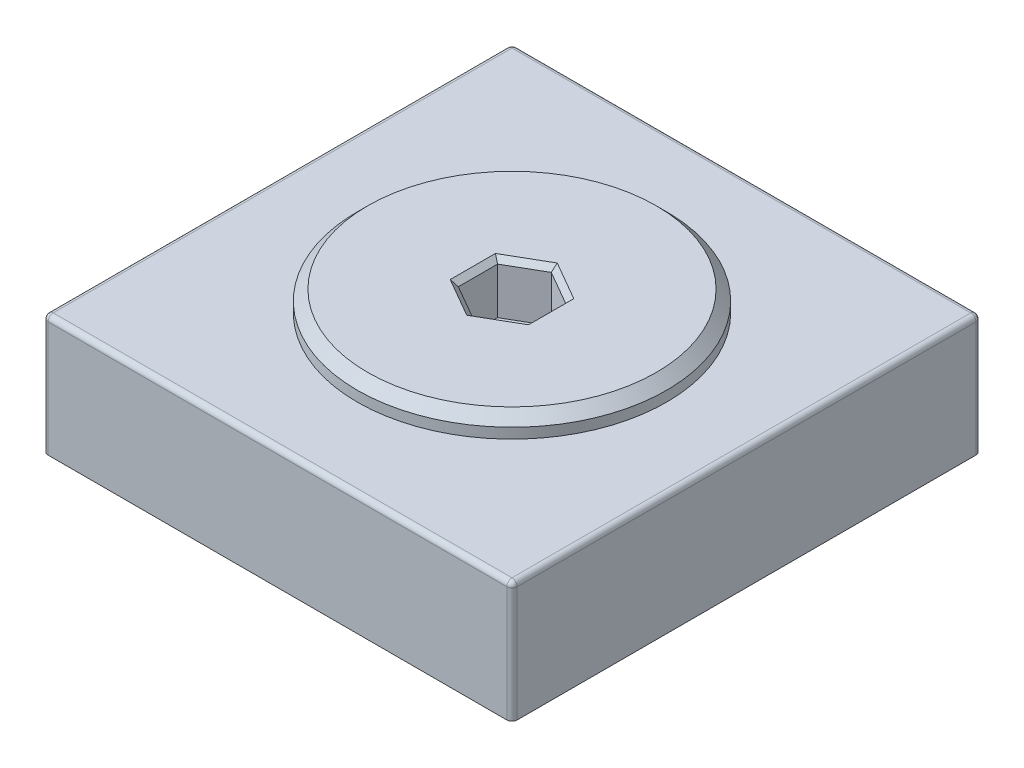
ISO-10303-21;
HEADER;
FILE_DESCRIPTION(('STEP AP214'),'2;1');
FILE_NAME('part.step','',(''),(''),'','','');
FILE_SCHEMA(('AUTOMOTIVE_DESIGN { 1 0 10303 214 1 1 1 1 }'));
ENDSEC;
DATA;
#1=APPLICATION_CONTEXT('core data for automotive mechanical design processes');
#2=APPLICATION_PROTOCOL_DEFINITION('international standard','automotive_design',2000,#1);
#3=PRODUCT_CONTEXT('',#1,'mechanical');
#4=PRODUCT('Part','Part','',(#3));
#5=PRODUCT_RELATED_PRODUCT_CATEGORY('part','',(#4));
#6=PRODUCT_DEFINITION_FORMATION('','',#4);
#7=PRODUCT_DEFINITION_CONTEXT('part definition',#1,'design');
#8=PRODUCT_DEFINITION('design','',#6,#7);
#9=PRODUCT_DEFINITION_SHAPE('','',#8);
#10=(LENGTH_UNIT() NAMED_UNIT(*) SI_UNIT(.MILLI.,.METRE.));
#11=(NAMED_UNIT(*) PLANE_ANGLE_UNIT() SI_UNIT($,.RADIAN.));
#12=(NAMED_UNIT(*) SI_UNIT($,.STERADIAN.) SOLID_ANGLE_UNIT());
#13=UNCERTAINTY_MEASURE_WITH_UNIT(LENGTH_MEASURE(1.E-05),#10,'distance_accuracy_value','');
#14=(GEOMETRIC_REPRESENTATION_CONTEXT(3) GLOBAL_UNCERTAINTY_ASSIGNED_CONTEXT((#13)) GLOBAL_UNIT_ASSIGNED_CONTEXT((#10,
#11,#12)) REPRESENTATION_CONTEXT('',''));
#15=CARTESIAN_POINT('',(0.,0.,0.));
#16=DIRECTION('',(0.,0.,1.));
#17=DIRECTION('',(1.,0.,0.));
#18=AXIS2_PLACEMENT_3D('',#15,#16,#17);
#19=CARTESIAN_POINT('',(22.75,11.7,22.75));
#20=DIRECTION('',(-1.,0.,0.));
#21=DIRECTION('',(0.,0.,1.));
#22=AXIS2_PLACEMENT_3D('',#19,#20,#21);
#23=PLANE('',#22);
#24=DIRECTION('',(0.,0.,-1.));
#25=VECTOR('',#24,1.);
#26=CARTESIAN_POINT('',(22.75,0.,22.75));
#27=LINE('',#26,#25);
#28=CARTESIAN_POINT('',(22.75,0.,22.25));
#29=VERTEX_POINT('',#28);
#30=CARTESIAN_POINT('',(22.75,0.,-22.25));
#31=VERTEX_POINT('',#30);
#32=EDGE_CURVE('E214',#29,#31,#27,.T.);
#33=ORIENTED_EDGE('',*,*,#32,.T.);
#34=DIRECTION('',(0.,-1.,0.));
#35=VECTOR('',#34,1.);
#36=CARTESIAN_POINT('',(22.75,11.7,-22.25));
#37=LINE('',#36,#35);
#38=CARTESIAN_POINT('',(22.75,11.2,-22.25));
#39=VERTEX_POINT('',#38);
#40=EDGE_CURVE('E300',#31,#39,#37,.F.);
#41=ORIENTED_EDGE('',*,*,#40,.T.);
#42=DIRECTION('',(0.,0.,-1.));
#43=VECTOR('',#42,1.);
#44=CARTESIAN_POINT('',(22.75,11.2,22.75));
#45=LINE('',#44,#43);
#46=CARTESIAN_POINT('',(22.75,11.2,22.25));
#47=VERTEX_POINT('',#46);
#48=EDGE_CURVE('E296',#39,#47,#45,.F.);
#49=ORIENTED_EDGE('',*,*,#48,.T.);
#50=DIRECTION('',(0.,-1.,0.));
#51=VECTOR('',#50,1.);
#52=CARTESIAN_POINT('',(22.75,11.7,22.25));
#53=LINE('',#52,#51);
#54=EDGE_CURVE('E298',#47,#29,#53,.T.);
#55=ORIENTED_EDGE('',*,*,#54,.T.);
#56=EDGE_LOOP('',(#33,#41,#49,#55));
#57=FACE_BOUND('',#56,.T.);
#58=ADVANCED_FACE('F39',(#57),#23,.F.);
#59=CARTESIAN_POINT('',(-22.75,11.7,-22.75));
#60=DIRECTION('',(0.,0.,1.));
#61=DIRECTION('',(1.,0.,0.));
#62=AXIS2_PLACEMENT_3D('',#59,#60,#61);
#63=PLANE('',#62);
#64=DIRECTION('',(-1.,0.,0.));
#65=VECTOR('',#64,1.);
#66=CARTESIAN_POINT('',(-22.75,11.2,-22.75));
#67=LINE('',#66,#65);
#68=CARTESIAN_POINT('',(-22.25,11.2,-22.75));
#69=VERTEX_POINT('',#68);
#70=CARTESIAN_POINT('',(22.25,11.2,-22.75));
#71=VERTEX_POINT('',#70);
#72=EDGE_CURVE('E269',#69,#71,#67,.F.);
#73=ORIENTED_EDGE('',*,*,#72,.T.);
#74=DIRECTION('',(0.,-1.,0.));
#75=VECTOR('',#74,1.);
#76=CARTESIAN_POINT('',(22.25,11.7,-22.75));
#77=LINE('',#76,#75);
#78=CARTESIAN_POINT('',(22.25,0.,-22.75));
#79=VERTEX_POINT('',#78);
#80=EDGE_CURVE('E285',#71,#79,#77,.T.);
#81=ORIENTED_EDGE('',*,*,#80,.T.);
#82=DIRECTION('',(-1.,0.,0.));
#83=VECTOR('',#82,1.);
#84=CARTESIAN_POINT('',(-22.75,0.,-22.75));
#85=LINE('',#84,#83);
#86=CARTESIAN_POINT('',(-22.25,0.,-22.75));
#87=VERTEX_POINT('',#86);
#88=EDGE_CURVE('E232',#79,#87,#85,.T.);
#89=ORIENTED_EDGE('',*,*,#88,.T.);
#90=DIRECTION('',(0.,-1.,0.));
#91=VECTOR('',#90,1.);
#92=CARTESIAN_POINT('',(-22.25,11.7,-22.75));
#93=LINE('',#92,#91);
#94=EDGE_CURVE('E283',#87,#69,#93,.F.);
#95=ORIENTED_EDGE('',*,*,#94,.T.);
#96=EDGE_LOOP('',(#73,#81,#89,#95));
#97=FACE_BOUND('',#96,.T.);
#98=ADVANCED_FACE('F423',(#97),#63,.F.);
#99=CARTESIAN_POINT('',(-22.75,11.7,22.75));
#100=DIRECTION('',(1.,0.,0.));
#101=DIRECTION('',(0.,0.,-1.));
#102=AXIS2_PLACEMENT_3D('',#99,#100,#101);
#103=PLANE('',#102);
#104=DIRECTION('',(0.,0.,1.));
#105=VECTOR('',#104,1.);
#106=CARTESIAN_POINT('',(-22.75,11.2,22.75));
#107=LINE('',#106,#105);
#108=CARTESIAN_POINT('',(-22.75,11.2,22.25));
#109=VERTEX_POINT('',#108);
#110=CARTESIAN_POINT('',(-22.75,11.2,-22.25));
#111=VERTEX_POINT('',#110);
#112=EDGE_CURVE('E302',#109,#111,#107,.F.);
#113=ORIENTED_EDGE('',*,*,#112,.T.);
#114=DIRECTION('',(0.,-1.,0.));
#115=VECTOR('',#114,1.);
#116=CARTESIAN_POINT('',(-22.75,11.7,-22.25));
#117=LINE('',#116,#115);
#118=CARTESIAN_POINT('',(-22.75,0.,-22.25));
#119=VERTEX_POINT('',#118);
#120=EDGE_CURVE('E306',#111,#119,#117,.T.);
#121=ORIENTED_EDGE('',*,*,#120,.T.);
#122=DIRECTION('',(0.,0.,1.));
#123=VECTOR('',#122,1.);
#124=CARTESIAN_POINT('',(-22.75,0.,22.75));
#125=LINE('',#124,#123);
#126=CARTESIAN_POINT('',(-22.75,0.,22.25));
#127=VERTEX_POINT('',#126);
#128=EDGE_CURVE('E235',#119,#127,#125,.T.);
#129=ORIENTED_EDGE('',*,*,#128,.T.);
#130=DIRECTION('',(0.,-1.,0.));
#131=VECTOR('',#130,1.);
#132=CARTESIAN_POINT('',(-22.75,11.7,22.25));
#133=LINE('',#132,#131);
#134=EDGE_CURVE('E304',#127,#109,#133,.F.);
#135=ORIENTED_EDGE('',*,*,#134,.T.);
#136=EDGE_LOOP('',(#113,#121,#129,#135));
#137=FACE_BOUND('',#136,.T.);
#138=ADVANCED_FACE('F429',(#137),#103,.F.);
#139=CARTESIAN_POINT('',(-22.75,11.7,22.75));
#140=DIRECTION('',(0.,0.,-1.));
#141=DIRECTION('',(-1.,0.,0.));
#142=AXIS2_PLACEMENT_3D('',#139,#140,#141);
#143=PLANE('',#142);
#144=DIRECTION('',(1.,0.,0.));
#145=VECTOR('',#144,1.);
#146=CARTESIAN_POINT('',(-22.75,0.,22.75));
#147=LINE('',#146,#145);
#148=CARTESIAN_POINT('',(-22.25,0.,22.75));
#149=VERTEX_POINT('',#148);
#150=CARTESIAN_POINT('',(22.25,0.,22.75));
#151=VERTEX_POINT('',#150);
#152=EDGE_CURVE('E229',#149,#151,#147,.T.);
#153=ORIENTED_EDGE('',*,*,#152,.T.);
#154=DIRECTION('',(0.,-1.,0.));
#155=VECTOR('',#154,1.);
#156=CARTESIAN_POINT('',(22.25,11.7,22.75));
#157=LINE('',#156,#155);
#158=CARTESIAN_POINT('',(22.25,11.2,22.75));
#159=VERTEX_POINT('',#158);
#160=EDGE_CURVE('E312',#151,#159,#157,.F.);
#161=ORIENTED_EDGE('',*,*,#160,.T.);
#162=DIRECTION('',(1.,0.,0.));
#163=VECTOR('',#162,1.);
#164=CARTESIAN_POINT('',(-22.75,11.2,22.75));
#165=LINE('',#164,#163);
#166=CARTESIAN_POINT('',(-22.25,11.2,22.75));
#167=VERTEX_POINT('',#166);
#168=EDGE_CURVE('E308',#159,#167,#165,.F.);
#169=ORIENTED_EDGE('',*,*,#168,.T.);
#170=DIRECTION('',(0.,-1.,0.));
#171=VECTOR('',#170,1.);
#172=CARTESIAN_POINT('',(-22.25,11.7,22.75));
#173=LINE('',#172,#171);
#174=EDGE_CURVE('E310',#167,#149,#173,.T.);
#175=ORIENTED_EDGE('',*,*,#174,.T.);
#176=EDGE_LOOP('',(#153,#161,#169,#175));
#177=FACE_BOUND('',#176,.T.);
#178=ADVANCED_FACE('F366',(#177),#143,.F.);
#179=CARTESIAN_POINT('',(0.,11.7,0.));
#180=DIRECTION('',(0.,-1.,0.));
#181=DIRECTION('',(0.,0.,-1.));
#182=AXIS2_PLACEMENT_3D('',#179,#180,#181);
#183=PLANE('',#182);
#184=DIRECTION('',(-1.,0.,0.));
#185=VECTOR('',#184,1.);
#186=CARTESIAN_POINT('',(0.,11.7,-22.25));
#187=LINE('',#186,#185);
#188=CARTESIAN_POINT('',(22.25,11.7,-22.25));
#189=VERTEX_POINT('',#188);
#190=CARTESIAN_POINT('',(-22.25,11.7,-22.25));
#191=VERTEX_POINT('',#190);
#192=EDGE_CURVE('E56',#189,#191,#187,.T.);
#193=ORIENTED_EDGE('',*,*,#192,.T.);
#194=DIRECTION('',(0.,0.,1.));
#195=VECTOR('',#194,1.);
#196=CARTESIAN_POINT('',(-22.25,11.7,0.));
#197=LINE('',#196,#195);
#198=CARTESIAN_POINT('',(-22.25,11.7,22.25));
#199=VERTEX_POINT('',#198);
#200=EDGE_CURVE('E48',#191,#199,#197,.T.);
#201=ORIENTED_EDGE('',*,*,#200,.T.);
#202=DIRECTION('',(1.,0.,0.));
#203=VECTOR('',#202,1.);
#204=CARTESIAN_POINT('',(0.,11.7,22.25));
#205=LINE('',#204,#203);
#206=CARTESIAN_POINT('',(22.25,11.7,22.25));
#207=VERTEX_POINT('',#206);
#208=EDGE_CURVE('E314',#199,#207,#205,.T.);
#209=ORIENTED_EDGE('',*,*,#208,.T.);
#210=DIRECTION('',(0.,0.,-1.));
#211=VECTOR('',#210,1.);
#212=CARTESIAN_POINT('',(22.25,11.7,0.));
#213=LINE('',#212,#211);
#214=EDGE_CURVE('E61',#207,#189,#213,.T.);
#215=ORIENTED_EDGE('',*,*,#214,.T.);
#216=EDGE_LOOP('',(#193,#201,#209,#215));
#217=FACE_BOUND('',#216,.T.);
#218=CARTESIAN_POINT('',(0.,11.7,0.));
#219=DIRECTION('',(0.,1.,0.));
#220=DIRECTION('',(0.,0.,1.));
#221=AXIS2_PLACEMENT_3D('',#218,#219,#220);
#222=CIRCLE('',#221,15.);
#223=CARTESIAN_POINT('',(0.,11.7,15.));
#224=VERTEX_POINT('',#223);
#225=EDGE_CURVE('E225',#224,#224,#222,.T.);
#226=ORIENTED_EDGE('',*,*,#225,.F.);
#227=EDGE_LOOP('',(#226));
#228=FACE_BOUND('',#227,.T.);
#229=ADVANCED_FACE('F402',(#217,#228),#183,.F.);
#230=CARTESIAN_POINT('',(0.,0.,0.));
#231=DIRECTION('',(0.,-1.,0.));
#232=DIRECTION('',(0.,0.,-1.));
#233=AXIS2_PLACEMENT_3D('',#230,#231,#232);
#234=PLANE('',#233);
#235=CARTESIAN_POINT('',(0.,0.,0.));
#236=DIRECTION('',(0.,-1.,0.));
#237=DIRECTION('',(0.,0.,-1.));
#238=AXIS2_PLACEMENT_3D('',#235,#236,#237);
#239=CIRCLE('',#238,15.);
#240=CARTESIAN_POINT('',(0.,0.,-15.));
#241=VERTEX_POINT('',#240);
#242=EDGE_CURVE('E11',#241,#241,#239,.T.);
#243=ORIENTED_EDGE('',*,*,#242,.F.);
#244=EDGE_LOOP('',(#243));
#245=FACE_BOUND('',#244,.T.);
#246=ORIENTED_EDGE('',*,*,#88,.F.);
#247=CARTESIAN_POINT('',(22.25,0.,-22.25));
#248=DIRECTION('',(0.,-1.,0.));
#249=DIRECTION('',(0.,0.,-1.));
#250=AXIS2_PLACEMENT_3D('',#247,#248,#249);
#251=CIRCLE('',#250,0.5);
#252=EDGE_CURVE('E294',#79,#31,#251,.T.);
#253=ORIENTED_EDGE('',*,*,#252,.T.);
#254=ORIENTED_EDGE('',*,*,#32,.F.);
#255=CARTESIAN_POINT('',(22.25,0.,22.25));
#256=DIRECTION('',(0.,-1.,0.));
#257=DIRECTION('',(0.,0.,-1.));
#258=AXIS2_PLACEMENT_3D('',#255,#256,#257);
#259=CIRCLE('',#258,0.5);
#260=EDGE_CURVE('E290',#29,#151,#259,.T.);
#261=ORIENTED_EDGE('',*,*,#260,.T.);
#262=ORIENTED_EDGE('',*,*,#152,.F.);
#263=CARTESIAN_POINT('',(-22.25,0.,22.25));
#264=DIRECTION('',(0.,-1.,0.));
#265=DIRECTION('',(0.,0.,-1.));
#266=AXIS2_PLACEMENT_3D('',#263,#264,#265);
#267=CIRCLE('',#266,0.5);
#268=EDGE_CURVE('E288',#149,#127,#267,.T.);
#269=ORIENTED_EDGE('',*,*,#268,.T.);
#270=ORIENTED_EDGE('',*,*,#128,.F.);
#271=CARTESIAN_POINT('',(-22.25,0.,-22.25));
#272=DIRECTION('',(0.,-1.,0.));
#273=DIRECTION('',(0.,0.,-1.));
#274=AXIS2_PLACEMENT_3D('',#271,#272,#273);
#275=CIRCLE('',#274,0.5);
#276=EDGE_CURVE('E292',#119,#87,#275,.T.);
#277=ORIENTED_EDGE('',*,*,#276,.T.);
#278=EDGE_LOOP('',(#246,#253,#254,#261,#262,#269,#270,#277));
#279=FACE_BOUND('',#278,.T.);
#280=ADVANCED_FACE('F370',(#245,#279),#234,.T.);
#281=CARTESIAN_POINT('',(0.,13.7,0.));
#282=DIRECTION('',(0.,-1.,0.));
#283=DIRECTION('',(0.,0.,-1.));
#284=AXIS2_PLACEMENT_3D('',#281,#282,#283);
#285=CYLINDRICAL_SURFACE('',#284,15.);
#286=CARTESIAN_POINT('',(0.,12.7,0.));
#287=DIRECTION('',(0.,1.,0.));
#288=DIRECTION('',(0.,0.,1.));
#289=AXIS2_PLACEMENT_3D('',#286,#287,#288);
#290=CIRCLE('',#289,15.);
#291=CARTESIAN_POINT('',(0.,12.7,15.));
#292=VERTEX_POINT('',#291);
#293=EDGE_CURVE('E242',#292,#292,#290,.F.);
#294=ORIENTED_EDGE('',*,*,#293,.T.);
#295=EDGE_LOOP('',(#294));
#296=FACE_BOUND('',#295,.T.);
#297=ORIENTED_EDGE('',*,*,#225,.T.);
#298=EDGE_LOOP('',(#297));
#299=FACE_BOUND('',#298,.T.);
#300=ADVANCED_FACE('F408',(#296,#299),#285,.T.);
#301=CARTESIAN_POINT('',(0.,13.7,0.));
#302=DIRECTION('',(0.,1.,0.));
#303=DIRECTION('',(0.,0.,1.));
#304=AXIS2_PLACEMENT_3D('',#301,#302,#303);
#305=PLANE('',#304);
#306=DIRECTION('',(0.,0.,-1.));
#307=VECTOR('',#306,1.);
#308=CARTESIAN_POINT('',(-3.8,13.7,-1.90525588832576));
#309=LINE('',#308,#307);
#310=CARTESIAN_POINT('',(-3.8,13.7,2.19393102292058));
#311=VERTEX_POINT('',#310);
#312=CARTESIAN_POINT('',(-3.8,13.7,-2.19393102292058));
#313=VERTEX_POINT('',#312);
#314=EDGE_CURVE('E255',#311,#313,#309,.T.);
#315=ORIENTED_EDGE('',*,*,#314,.T.);
#316=DIRECTION('',(0.866025403784439,0.,-0.5));
#317=VECTOR('',#316,1.);
#318=CARTESIAN_POINT('',(-0.250000000000003,13.7,-4.24352447854375));
#319=LINE('',#318,#317);
#320=CARTESIAN_POINT('',(0.,13.7,-4.38786204584116));
#321=VERTEX_POINT('',#320);
#322=EDGE_CURVE('E257',#313,#321,#319,.T.);
#323=ORIENTED_EDGE('',*,*,#322,.T.);
#324=DIRECTION('',(0.866025403784439,0.,0.5));
#325=VECTOR('',#324,1.);
#326=CARTESIAN_POINT('',(3.55,13.7,-2.33826859021799));
#327=LINE('',#326,#325);
#328=CARTESIAN_POINT('',(3.8,13.7,-2.19393102292058));
#329=VERTEX_POINT('',#328);
#330=EDGE_CURVE('E247',#321,#329,#327,.T.);
#331=ORIENTED_EDGE('',*,*,#330,.T.);
#332=DIRECTION('',(0.,0.,1.));
#333=VECTOR('',#332,1.);
#334=CARTESIAN_POINT('',(3.8,13.7,1.90525588832576));
#335=LINE('',#334,#333);
#336=CARTESIAN_POINT('',(3.8,13.7,2.19393102292058));
#337=VERTEX_POINT('',#336);
#338=EDGE_CURVE('E249',#329,#337,#335,.T.);
#339=ORIENTED_EDGE('',*,*,#338,.T.);
#340=DIRECTION('',(-0.866025403784439,0.,0.5));
#341=VECTOR('',#340,1.);
#342=CARTESIAN_POINT('',(0.250000000000001,13.7,4.24352447854375));
#343=LINE('',#342,#341);
#344=CARTESIAN_POINT('',(0.,13.7,4.38786204584116));
#345=VERTEX_POINT('',#344);
#346=EDGE_CURVE('E251',#337,#345,#343,.T.);
#347=ORIENTED_EDGE('',*,*,#346,.T.);
#348=DIRECTION('',(-0.866025403784439,0.,-0.5));
#349=VECTOR('',#348,1.);
#350=CARTESIAN_POINT('',(-3.55,13.7,2.33826859021799));
#351=LINE('',#350,#349);
#352=EDGE_CURVE('E253',#345,#311,#351,.T.);
#353=ORIENTED_EDGE('',*,*,#352,.T.);
#354=EDGE_LOOP('',(#315,#323,#331,#339,#347,#353));
#355=FACE_BOUND('',#354,.T.);
#356=CARTESIAN_POINT('',(0.,13.7,0.));
#357=DIRECTION('',(0.,1.,0.));
#358=DIRECTION('',(0.,0.,1.));
#359=AXIS2_PLACEMENT_3D('',#356,#357,#358);
#360=CIRCLE('',#359,14.);
#361=CARTESIAN_POINT('',(0.,13.7,14.));
#362=VERTEX_POINT('',#361);
#363=EDGE_CURVE('E228',#362,#362,#360,.T.);
#364=ORIENTED_EDGE('',*,*,#363,.T.);
#365=EDGE_LOOP('',(#364));
#366=FACE_BOUND('',#365,.T.);
#367=ADVANCED_FACE('F410',(#355,#366),#305,.T.);
#368=CARTESIAN_POINT('',(0.,13.7,0.));
#369=DIRECTION('',(0.,-1.,0.));
#370=DIRECTION('',(0.,0.,-1.));
#371=AXIS2_PLACEMENT_3D('',#368,#369,#370);
#372=CONICAL_SURFACE('',#371,14.,0.785398163397451);
#373=ORIENTED_EDGE('',*,*,#293,.F.);
#374=EDGE_LOOP('',(#373));
#375=FACE_BOUND('',#374,.T.);
#376=ORIENTED_EDGE('',*,*,#363,.F.);
#377=EDGE_LOOP('',(#376));
#378=FACE_BOUND('',#377,.T.);
#379=ADVANCED_FACE('F417',(#375,#378),#372,.T.);
#380=CARTESIAN_POINT('',(3.3,8.7,-1.90525588832577));
#381=DIRECTION('',(0.5,0.,-0.866025403784439));
#382=DIRECTION('',(-0.866025403784439,0.,-0.5));
#383=AXIS2_PLACEMENT_3D('',#380,#381,#382);
#384=PLANE('',#383);
#385=DIRECTION('',(0.,1.,0.));
#386=VECTOR('',#385,1.);
#387=CARTESIAN_POINT('',(3.3,8.7,-1.90525588832577));
#388=LINE('',#387,#386);
#389=CARTESIAN_POINT('',(3.3,8.7,-1.90525588832577));
#390=VERTEX_POINT('',#389);
#391=CARTESIAN_POINT('',(3.3,13.2,-1.90525588832577));
#392=VERTEX_POINT('',#391);
#393=EDGE_CURVE('E212',#390,#392,#388,.T.);
#394=ORIENTED_EDGE('',*,*,#393,.T.);
#395=DIRECTION('',(-0.866025403784439,0.,-0.5));
#396=VECTOR('',#395,1.);
#397=CARTESIAN_POINT('',(0.,13.2,-3.81051177665153));
#398=LINE('',#397,#396);
#399=CARTESIAN_POINT('',(0.,13.2,-3.81051177665153));
#400=VERTEX_POINT('',#399);
#401=EDGE_CURVE('E179',#392,#400,#398,.T.);
#402=ORIENTED_EDGE('',*,*,#401,.T.);
#403=DIRECTION('',(0.,1.,0.));
#404=VECTOR('',#403,1.);
#405=CARTESIAN_POINT('',(0.,8.7,-3.81051177665153));
#406=LINE('',#405,#404);
#407=CARTESIAN_POINT('',(0.,8.7,-3.81051177665153));
#408=VERTEX_POINT('',#407);
#409=EDGE_CURVE('E171',#408,#400,#406,.T.);
#410=ORIENTED_EDGE('',*,*,#409,.F.);
#411=DIRECTION('',(-0.866025403784439,0.,-0.5));
#412=VECTOR('',#411,1.);
#413=CARTESIAN_POINT('',(3.3,8.7,-1.90525588832577));
#414=LINE('',#413,#412);
#415=EDGE_CURVE('E176',#390,#408,#414,.T.);
#416=ORIENTED_EDGE('',*,*,#415,.F.);
#417=EDGE_LOOP('',(#394,#402,#410,#416));
#418=FACE_BOUND('',#417,.T.);
#419=ADVANCED_FACE('F174',(#418),#384,.F.);
#420=CARTESIAN_POINT('',(3.3,8.7,1.90525588832576));
#421=DIRECTION('',(1.,0.,0.));
#422=DIRECTION('',(0.,0.,-1.));
#423=AXIS2_PLACEMENT_3D('',#420,#421,#422);
#424=PLANE('',#423);
#425=DIRECTION('',(0.,1.,0.));
#426=VECTOR('',#425,1.);
#427=CARTESIAN_POINT('',(3.3,8.7,1.90525588832576));
#428=LINE('',#427,#426);
#429=CARTESIAN_POINT('',(3.3,8.7,1.90525588832576));
#430=VERTEX_POINT('',#429);
#431=CARTESIAN_POINT('',(3.3,13.2,1.90525588832576));
#432=VERTEX_POINT('',#431);
#433=EDGE_CURVE('E215',#430,#432,#428,.T.);
#434=ORIENTED_EDGE('',*,*,#433,.T.);
#435=DIRECTION('',(0.,0.,-1.));
#436=VECTOR('',#435,1.);
#437=CARTESIAN_POINT('',(3.3,13.2,-1.90525588832577));
#438=LINE('',#437,#436);
#439=EDGE_CURVE('E266',#432,#392,#438,.T.);
#440=ORIENTED_EDGE('',*,*,#439,.T.);
#441=ORIENTED_EDGE('',*,*,#393,.F.);
#442=DIRECTION('',(0.,0.,-1.));
#443=VECTOR('',#442,1.);
#444=CARTESIAN_POINT('',(3.3,8.7,1.90525588832576));
#445=LINE('',#444,#443);
#446=EDGE_CURVE('E184',#430,#390,#445,.T.);
#447=ORIENTED_EDGE('',*,*,#446,.F.);
#448=EDGE_LOOP('',(#434,#440,#441,#447));
#449=FACE_BOUND('',#448,.T.);
#450=ADVANCED_FACE('F574',(#449),#424,.F.);
#451=CARTESIAN_POINT('',(0.,8.7,3.81051177665153));
#452=DIRECTION('',(0.5,0.,0.866025403784439));
#453=DIRECTION('',(0.866025403784439,0.,-0.5));
#454=AXIS2_PLACEMENT_3D('',#451,#452,#453);
#455=PLANE('',#454);
#456=DIRECTION('',(0.,1.,0.));
#457=VECTOR('',#456,1.);
#458=CARTESIAN_POINT('',(0.,8.7,3.81051177665153));
#459=LINE('',#458,#457);
#460=CARTESIAN_POINT('',(0.,8.7,3.81051177665153));
#461=VERTEX_POINT('',#460);
#462=CARTESIAN_POINT('',(0.,13.2,3.81051177665153));
#463=VERTEX_POINT('',#462);
#464=EDGE_CURVE('E218',#461,#463,#459,.T.);
#465=ORIENTED_EDGE('',*,*,#464,.T.);
#466=DIRECTION('',(0.866025403784439,0.,-0.5));
#467=VECTOR('',#466,1.);
#468=CARTESIAN_POINT('',(3.3,13.2,1.90525588832576));
#469=LINE('',#468,#467);
#470=EDGE_CURVE('E264',#463,#432,#469,.T.);
#471=ORIENTED_EDGE('',*,*,#470,.T.);
#472=ORIENTED_EDGE('',*,*,#433,.F.);
#473=DIRECTION('',(0.866025403784439,0.,-0.5));
#474=VECTOR('',#473,1.);
#475=CARTESIAN_POINT('',(0.,8.7,3.81051177665153));
#476=LINE('',#475,#474);
#477=EDGE_CURVE('E209',#461,#430,#476,.T.);
#478=ORIENTED_EDGE('',*,*,#477,.F.);
#479=EDGE_LOOP('',(#465,#471,#472,#478));
#480=FACE_BOUND('',#479,.T.);
#481=ADVANCED_FACE('F566',(#480),#455,.F.);
#482=CARTESIAN_POINT('',(-3.3,8.7,1.90525588832577));
#483=DIRECTION('',(-0.5,0.,0.866025403784439));
#484=DIRECTION('',(0.866025403784439,0.,0.5));
#485=AXIS2_PLACEMENT_3D('',#482,#483,#484);
#486=PLANE('',#485);
#487=DIRECTION('',(0.,1.,0.));
#488=VECTOR('',#487,1.);
#489=CARTESIAN_POINT('',(-3.3,8.7,1.90525588832577));
#490=LINE('',#489,#488);
#491=CARTESIAN_POINT('',(-3.3,8.7,1.90525588832577));
#492=VERTEX_POINT('',#491);
#493=CARTESIAN_POINT('',(-3.3,13.2,1.90525588832577));
#494=VERTEX_POINT('',#493);
#495=EDGE_CURVE('E221',#492,#494,#490,.T.);
#496=ORIENTED_EDGE('',*,*,#495,.T.);
#497=DIRECTION('',(0.866025403784439,0.,0.5));
#498=VECTOR('',#497,1.);
#499=CARTESIAN_POINT('',(0.,13.2,3.81051177665153));
#500=LINE('',#499,#498);
#501=EDGE_CURVE('E262',#494,#463,#500,.T.);
#502=ORIENTED_EDGE('',*,*,#501,.T.);
#503=ORIENTED_EDGE('',*,*,#464,.F.);
#504=DIRECTION('',(0.866025403784439,0.,0.5));
#505=VECTOR('',#504,1.);
#506=CARTESIAN_POINT('',(-3.3,8.7,1.90525588832577));
#507=LINE('',#506,#505);
#508=EDGE_CURVE('E206',#492,#461,#507,.T.);
#509=ORIENTED_EDGE('',*,*,#508,.F.);
#510=EDGE_LOOP('',(#496,#502,#503,#509));
#511=FACE_BOUND('',#510,.T.);
#512=ADVANCED_FACE('F558',(#511),#486,.F.);
#513=CARTESIAN_POINT('',(-3.3,8.7,-1.90525588832576));
#514=DIRECTION('',(-1.,0.,0.));
#515=DIRECTION('',(0.,0.,1.));
#516=AXIS2_PLACEMENT_3D('',#513,#514,#515);
#517=PLANE('',#516);
#518=DIRECTION('',(0.,1.,0.));
#519=VECTOR('',#518,1.);
#520=CARTESIAN_POINT('',(-3.3,8.7,-1.90525588832576));
#521=LINE('',#520,#519);
#522=CARTESIAN_POINT('',(-3.3,8.7,-1.90525588832576));
#523=VERTEX_POINT('',#522);
#524=CARTESIAN_POINT('',(-3.3,13.2,-1.90525588832576));
#525=VERTEX_POINT('',#524);
#526=EDGE_CURVE('E183',#523,#525,#521,.T.);
#527=ORIENTED_EDGE('',*,*,#526,.T.);
#528=DIRECTION('',(0.,0.,1.));
#529=VECTOR('',#528,1.);
#530=CARTESIAN_POINT('',(-3.3,13.2,1.90525588832576));
#531=LINE('',#530,#529);
#532=EDGE_CURVE('E260',#525,#494,#531,.T.);
#533=ORIENTED_EDGE('',*,*,#532,.T.);
#534=ORIENTED_EDGE('',*,*,#495,.F.);
#535=DIRECTION('',(0.,0.,1.));
#536=VECTOR('',#535,1.);
#537=CARTESIAN_POINT('',(-3.3,8.7,-1.90525588832576));
#538=LINE('',#537,#536);
#539=EDGE_CURVE('E193',#523,#492,#538,.T.);
#540=ORIENTED_EDGE('',*,*,#539,.F.);
#541=EDGE_LOOP('',(#527,#533,#534,#540));
#542=FACE_BOUND('',#541,.T.);
#543=ADVANCED_FACE('F551',(#542),#517,.F.);
#544=CARTESIAN_POINT('',(0.,8.7,-3.81051177665153));
#545=DIRECTION('',(-0.5,0.,-0.866025403784439));
#546=DIRECTION('',(-0.866025403784439,0.,0.5));
#547=AXIS2_PLACEMENT_3D('',#544,#545,#546);
#548=PLANE('',#547);
#549=ORIENTED_EDGE('',*,*,#409,.T.);
#550=DIRECTION('',(-0.866025403784439,0.,0.5));
#551=VECTOR('',#550,1.);
#552=CARTESIAN_POINT('',(-3.3,13.2,-1.90525588832576));
#553=LINE('',#552,#551);
#554=EDGE_CURVE('E245',#400,#525,#553,.T.);
#555=ORIENTED_EDGE('',*,*,#554,.T.);
#556=ORIENTED_EDGE('',*,*,#526,.F.);
#557=DIRECTION('',(-0.866025403784439,0.,0.5));
#558=VECTOR('',#557,1.);
#559=CARTESIAN_POINT('',(0.,8.7,-3.81051177665153));
#560=LINE('',#559,#558);
#561=EDGE_CURVE('E187',#408,#523,#560,.T.);
#562=ORIENTED_EDGE('',*,*,#561,.F.);
#563=EDGE_LOOP('',(#549,#555,#556,#562));
#564=FACE_BOUND('',#563,.T.);
#565=ADVANCED_FACE('F188',(#564),#548,.F.);
#566=CARTESIAN_POINT('',(0.,8.7,0.));
#567=DIRECTION('',(0.,1.,0.));
#568=DIRECTION('',(0.,0.,1.));
#569=AXIS2_PLACEMENT_3D('',#566,#567,#568);
#570=PLANE('',#569);
#571=ORIENTED_EDGE('',*,*,#415,.T.);
#572=ORIENTED_EDGE('',*,*,#561,.T.);
#573=ORIENTED_EDGE('',*,*,#539,.T.);
#574=ORIENTED_EDGE('',*,*,#508,.T.);
#575=ORIENTED_EDGE('',*,*,#477,.T.);
#576=ORIENTED_EDGE('',*,*,#446,.T.);
#577=EDGE_LOOP('',(#571,#572,#573,#574,#575,#576));
#578=FACE_BOUND('',#577,.T.);
#579=ADVANCED_FACE('F195',(#578),#570,.T.);
#580=CARTESIAN_POINT('',(0.,13.2,3.81051177665153));
#581=DIRECTION('',(-0.353553390593273,0.707106781186549,-0.612372435695794));
#582=DIRECTION('',(-0.866025403784439,0.,0.5));
#583=AXIS2_PLACEMENT_3D('',#580,#581,#582);
#584=PLANE('',#583);
#585=DIRECTION('',(0.,0.654653670707976,0.755928946018456));
#586=VECTOR('',#585,1.);
#587=CARTESIAN_POINT('',(0.,12.2571428571429,2.72179412617966));
#588=LINE('',#587,#586);
#589=EDGE_CURVE('E201',#345,#463,#588,.F.);
#590=ORIENTED_EDGE('',*,*,#589,.F.);
#591=ORIENTED_EDGE('',*,*,#346,.F.);
#592=DIRECTION('',(0.654653670707978,0.654653670707976,0.377964473009227));
#593=VECTOR('',#592,1.);
#594=CARTESIAN_POINT('',(2.35714285714285,12.2571428571429,1.36089706308983));
#595=LINE('',#594,#593);
#596=EDGE_CURVE('E198',#432,#337,#595,.T.);
#597=ORIENTED_EDGE('',*,*,#596,.F.);
#598=ORIENTED_EDGE('',*,*,#470,.F.);
#599=EDGE_LOOP('',(#590,#591,#597,#598));
#600=FACE_BOUND('',#599,.T.);
#601=ADVANCED_FACE('F475',(#600),#584,.T.);
#602=CARTESIAN_POINT('',(3.3,13.2,1.90525588832576));
#603=DIRECTION('',(-0.707106781186546,0.707106781186549,0.));
#604=DIRECTION('',(0.,0.,1.));
#605=AXIS2_PLACEMENT_3D('',#602,#603,#604);
#606=PLANE('',#605);
#607=ORIENTED_EDGE('',*,*,#596,.T.);
#608=ORIENTED_EDGE('',*,*,#338,.F.);
#609=DIRECTION('',(0.654653670707978,0.654653670707976,-0.377964473009228));
#610=VECTOR('',#609,1.);
#611=CARTESIAN_POINT('',(2.35714285714285,12.2571428571429,-1.36089706308983));
#612=LINE('',#611,#610);
#613=EDGE_CURVE('E277',#392,#329,#612,.T.);
#614=ORIENTED_EDGE('',*,*,#613,.F.);
#615=ORIENTED_EDGE('',*,*,#439,.F.);
#616=EDGE_LOOP('',(#607,#608,#614,#615));
#617=FACE_BOUND('',#616,.T.);
#618=ADVANCED_FACE('F469',(#617),#606,.T.);
#619=CARTESIAN_POINT('',(-3.3,13.2,1.90525588832577));
#620=DIRECTION('',(0.353553390593273,0.707106781186549,-0.612372435695793));
#621=DIRECTION('',(-0.866025403784439,0.,-0.5));
#622=AXIS2_PLACEMENT_3D('',#619,#620,#621);
#623=PLANE('',#622);
#624=ORIENTED_EDGE('',*,*,#589,.T.);
#625=ORIENTED_EDGE('',*,*,#501,.F.);
#626=DIRECTION('',(-0.654653670707978,0.654653670707976,0.377964473009228));
#627=VECTOR('',#626,1.);
#628=CARTESIAN_POINT('',(-2.35714285714285,12.2571428571429,1.36089706308983));
#629=LINE('',#628,#627);
#630=EDGE_CURVE('E274',#311,#494,#629,.F.);
#631=ORIENTED_EDGE('',*,*,#630,.F.);
#632=ORIENTED_EDGE('',*,*,#352,.F.);
#633=EDGE_LOOP('',(#624,#625,#631,#632));
#634=FACE_BOUND('',#633,.T.);
#635=ADVANCED_FACE('F462',(#634),#623,.T.);
#636=CARTESIAN_POINT('',(3.3,13.2,-1.90525588832577));
#637=DIRECTION('',(-0.353553390593273,0.707106781186549,0.612372435695793));
#638=DIRECTION('',(0.866025403784439,0.,0.5));
#639=AXIS2_PLACEMENT_3D('',#636,#637,#638);
#640=PLANE('',#639);
#641=ORIENTED_EDGE('',*,*,#613,.T.);
#642=ORIENTED_EDGE('',*,*,#330,.F.);
#643=DIRECTION('',(0.,-0.654653670707976,0.755928946018456));
#644=VECTOR('',#643,1.);
#645=CARTESIAN_POINT('',(0.,13.2,-3.81051177665153));
#646=LINE('',#645,#644);
#647=EDGE_CURVE('E272',#400,#321,#646,.F.);
#648=ORIENTED_EDGE('',*,*,#647,.F.);
#649=ORIENTED_EDGE('',*,*,#401,.F.);
#650=EDGE_LOOP('',(#641,#642,#648,#649));
#651=FACE_BOUND('',#650,.T.);
#652=ADVANCED_FACE('F455',(#651),#640,.T.);
#653=CARTESIAN_POINT('',(-3.3,13.2,-1.90525588832576));
#654=DIRECTION('',(0.707106781186546,0.707106781186549,0.));
#655=DIRECTION('',(0.,0.,-1.));
#656=AXIS2_PLACEMENT_3D('',#653,#654,#655);
#657=PLANE('',#656);
#658=ORIENTED_EDGE('',*,*,#630,.T.);
#659=ORIENTED_EDGE('',*,*,#532,.F.);
#660=DIRECTION('',(-0.654653670707979,0.654653670707975,-0.377964473009228));
#661=VECTOR('',#660,1.);
#662=CARTESIAN_POINT('',(-2.35714285714285,12.2571428571429,-1.36089706308983));
#663=LINE('',#662,#661);
#664=EDGE_CURVE('E270',#313,#525,#663,.F.);
#665=ORIENTED_EDGE('',*,*,#664,.F.);
#666=ORIENTED_EDGE('',*,*,#314,.F.);
#667=EDGE_LOOP('',(#658,#659,#665,#666));
#668=FACE_BOUND('',#667,.T.);
#669=ADVANCED_FACE('F448',(#668),#657,.T.);
#670=CARTESIAN_POINT('',(0.,13.2,-3.81051177665153));
#671=DIRECTION('',(0.353553390593273,0.707106781186549,0.612372435695793));
#672=DIRECTION('',(0.866025403784439,0.,-0.5));
#673=AXIS2_PLACEMENT_3D('',#670,#671,#672);
#674=PLANE('',#673);
#675=ORIENTED_EDGE('',*,*,#647,.T.);
#676=ORIENTED_EDGE('',*,*,#322,.F.);
#677=ORIENTED_EDGE('',*,*,#664,.T.);
#678=ORIENTED_EDGE('',*,*,#554,.F.);
#679=EDGE_LOOP('',(#675,#676,#677,#678));
#680=FACE_BOUND('',#679,.T.);
#681=ADVANCED_FACE('F442',(#680),#674,.T.);
#682=CARTESIAN_POINT('',(-22.25,11.7,22.25));
#683=DIRECTION('',(0.,-1.,0.));
#684=DIRECTION('',(0.,0.,-1.));
#685=AXIS2_PLACEMENT_3D('',#682,#683,#684);
#686=CYLINDRICAL_SURFACE('',#685,0.5);
#687=CARTESIAN_POINT('',(-22.25,11.2,22.25));
#688=DIRECTION('',(0.,1.,0.));
#689=DIRECTION('',(0.,0.,1.));
#690=AXIS2_PLACEMENT_3D('',#687,#688,#689);
#691=CIRCLE('',#690,0.5);
#692=EDGE_CURVE('E43',#109,#167,#691,.T.);
#693=ORIENTED_EDGE('',*,*,#692,.F.);
#694=ORIENTED_EDGE('',*,*,#134,.F.);
#695=ORIENTED_EDGE('',*,*,#268,.F.);
#696=ORIENTED_EDGE('',*,*,#174,.F.);
#697=EDGE_LOOP('',(#693,#694,#695,#696));
#698=FACE_BOUND('',#697,.T.);
#699=ADVANCED_FACE('F41',(#698),#686,.T.);
#700=CARTESIAN_POINT('',(-22.25,11.2,22.25));
#701=DIRECTION('',(0.,0.,1.));
#702=DIRECTION('',(1.,0.,0.));
#703=AXIS2_PLACEMENT_3D('',#700,#701,#702);
#704=SPHERICAL_SURFACE('',#703,0.5);
#705=CARTESIAN_POINT('',(-22.25,11.2,22.25));
#706=DIRECTION('',(0.,0.,1.));
#707=DIRECTION('',(1.,0.,0.));
#708=AXIS2_PLACEMENT_3D('',#705,#706,#707);
#709=CIRCLE('',#708,0.5);
#710=EDGE_CURVE('E347',#109,#199,#709,.F.);
#711=ORIENTED_EDGE('',*,*,#710,.F.);
#712=ORIENTED_EDGE('',*,*,#692,.T.);
#713=CARTESIAN_POINT('',(-22.25,11.2,22.25));
#714=DIRECTION('',(-1.,0.,0.));
#715=DIRECTION('',(0.,0.,1.));
#716=AXIS2_PLACEMENT_3D('',#713,#714,#715);
#717=CIRCLE('',#716,0.5);
#718=EDGE_CURVE('E349',#199,#167,#717,.F.);
#719=ORIENTED_EDGE('',*,*,#718,.F.);
#720=EDGE_LOOP('',(#711,#712,#719));
#721=FACE_BOUND('',#720,.T.);
#722=ADVANCED_FACE('F358',(#721),#704,.T.);
#723=CARTESIAN_POINT('',(22.25,11.7,22.25));
#724=DIRECTION('',(0.,-1.,0.));
#725=DIRECTION('',(0.,0.,-1.));
#726=AXIS2_PLACEMENT_3D('',#723,#724,#725);
#727=CYLINDRICAL_SURFACE('',#726,0.5);
#728=ORIENTED_EDGE('',*,*,#260,.F.);
#729=ORIENTED_EDGE('',*,*,#54,.F.);
#730=CARTESIAN_POINT('',(22.25,11.2,22.25));
#731=DIRECTION('',(0.,1.,0.));
#732=DIRECTION('',(0.,0.,1.));
#733=AXIS2_PLACEMENT_3D('',#730,#731,#732);
#734=CIRCLE('',#733,0.5);
#735=EDGE_CURVE('E344',#159,#47,#734,.T.);
#736=ORIENTED_EDGE('',*,*,#735,.F.);
#737=ORIENTED_EDGE('',*,*,#160,.F.);
#738=EDGE_LOOP('',(#728,#729,#736,#737));
#739=FACE_BOUND('',#738,.T.);
#740=ADVANCED_FACE('F376',(#739),#727,.T.);
#741=CARTESIAN_POINT('',(0.,11.2,22.25));
#742=DIRECTION('',(1.,0.,0.));
#743=DIRECTION('',(0.,0.,-1.));
#744=AXIS2_PLACEMENT_3D('',#741,#742,#743);
#745=CYLINDRICAL_SURFACE('',#744,0.5);
#746=ORIENTED_EDGE('',*,*,#718,.T.);
#747=ORIENTED_EDGE('',*,*,#168,.F.);
#748=CARTESIAN_POINT('',(22.25,11.2,22.25));
#749=DIRECTION('',(1.,0.,0.));
#750=DIRECTION('',(0.,0.,-1.));
#751=AXIS2_PLACEMENT_3D('',#748,#749,#750);
#752=CIRCLE('',#751,0.5);
#753=EDGE_CURVE('E341',#207,#159,#752,.T.);
#754=ORIENTED_EDGE('',*,*,#753,.F.);
#755=ORIENTED_EDGE('',*,*,#208,.F.);
#756=EDGE_LOOP('',(#746,#747,#754,#755));
#757=FACE_BOUND('',#756,.T.);
#758=ADVANCED_FACE('F379',(#757),#745,.T.);
#759=CARTESIAN_POINT('',(-22.25,11.2,0.));
#760=DIRECTION('',(0.,0.,1.));
#761=DIRECTION('',(1.,0.,0.));
#762=AXIS2_PLACEMENT_3D('',#759,#760,#761);
#763=CYLINDRICAL_SURFACE('',#762,0.5);
#764=ORIENTED_EDGE('',*,*,#710,.T.);
#765=ORIENTED_EDGE('',*,*,#200,.F.);
#766=CARTESIAN_POINT('',(-22.25,11.2,-22.25));
#767=DIRECTION('',(0.,0.,-1.));
#768=DIRECTION('',(-1.,0.,0.));
#769=AXIS2_PLACEMENT_3D('',#766,#767,#768);
#770=CIRCLE('',#769,0.5);
#771=EDGE_CURVE('E338',#111,#191,#770,.T.);
#772=ORIENTED_EDGE('',*,*,#771,.F.);
#773=ORIENTED_EDGE('',*,*,#112,.F.);
#774=EDGE_LOOP('',(#764,#765,#772,#773));
#775=FACE_BOUND('',#774,.T.);
#776=ADVANCED_FACE('F401',(#775),#763,.T.);
#777=CARTESIAN_POINT('',(-22.25,11.7,-22.25));
#778=DIRECTION('',(0.,-1.,0.));
#779=DIRECTION('',(0.,0.,-1.));
#780=AXIS2_PLACEMENT_3D('',#777,#778,#779);
#781=CYLINDRICAL_SURFACE('',#780,0.5);
#782=ORIENTED_EDGE('',*,*,#276,.F.);
#783=ORIENTED_EDGE('',*,*,#120,.F.);
#784=CARTESIAN_POINT('',(-22.25,11.2,-22.25));
#785=DIRECTION('',(0.,1.,0.));
#786=DIRECTION('',(0.,0.,1.));
#787=AXIS2_PLACEMENT_3D('',#784,#785,#786);
#788=CIRCLE('',#787,0.5);
#789=EDGE_CURVE('E335',#69,#111,#788,.T.);
#790=ORIENTED_EDGE('',*,*,#789,.F.);
#791=ORIENTED_EDGE('',*,*,#94,.F.);
#792=EDGE_LOOP('',(#782,#783,#790,#791));
#793=FACE_BOUND('',#792,.T.);
#794=ADVANCED_FACE('F497',(#793),#781,.T.);
#795=CARTESIAN_POINT('',(22.25,11.2,22.25));
#796=DIRECTION('',(0.,0.,1.));
#797=DIRECTION('',(1.,0.,0.));
#798=AXIS2_PLACEMENT_3D('',#795,#796,#797);
#799=SPHERICAL_SURFACE('',#798,0.5);
#800=ORIENTED_EDGE('',*,*,#753,.T.);
#801=ORIENTED_EDGE('',*,*,#735,.T.);
#802=CARTESIAN_POINT('',(22.25,11.2,22.25));
#803=DIRECTION('',(0.,0.,1.));
#804=DIRECTION('',(1.,0.,0.));
#805=AXIS2_PLACEMENT_3D('',#802,#803,#804);
#806=CIRCLE('',#805,0.5);
#807=EDGE_CURVE('E332',#207,#47,#806,.F.);
#808=ORIENTED_EDGE('',*,*,#807,.F.);
#809=EDGE_LOOP('',(#800,#801,#808));
#810=FACE_BOUND('',#809,.T.);
#811=ADVANCED_FACE('F382',(#810),#799,.T.);
#812=CARTESIAN_POINT('',(-22.25,11.2,-22.25));
#813=DIRECTION('',(-1.,0.,0.));
#814=DIRECTION('',(0.,0.,1.));
#815=AXIS2_PLACEMENT_3D('',#812,#813,#814);
#816=SPHERICAL_SURFACE('',#815,0.5);
#817=ORIENTED_EDGE('',*,*,#789,.T.);
#818=ORIENTED_EDGE('',*,*,#771,.T.);
#819=CARTESIAN_POINT('',(-22.25,11.2,-22.25));
#820=DIRECTION('',(-1.,0.,0.));
#821=DIRECTION('',(0.,0.,1.));
#822=AXIS2_PLACEMENT_3D('',#819,#820,#821);
#823=CIRCLE('',#822,0.5);
#824=EDGE_CURVE('E329',#69,#191,#823,.F.);
#825=ORIENTED_EDGE('',*,*,#824,.F.);
#826=EDGE_LOOP('',(#817,#818,#825));
#827=FACE_BOUND('',#826,.T.);
#828=ADVANCED_FACE('F397',(#827),#816,.T.);
#829=CARTESIAN_POINT('',(22.25,11.2,0.));
#830=DIRECTION('',(0.,0.,-1.));
#831=DIRECTION('',(-1.,0.,0.));
#832=AXIS2_PLACEMENT_3D('',#829,#830,#831);
#833=CYLINDRICAL_SURFACE('',#832,0.5);
#834=ORIENTED_EDGE('',*,*,#807,.T.);
#835=ORIENTED_EDGE('',*,*,#48,.F.);
#836=CARTESIAN_POINT('',(22.25,11.2,-22.25));
#837=DIRECTION('',(0.,0.,-1.));
#838=DIRECTION('',(-1.,0.,0.));
#839=AXIS2_PLACEMENT_3D('',#836,#837,#838);
#840=CIRCLE('',#839,0.5);
#841=EDGE_CURVE('E326',#189,#39,#840,.T.);
#842=ORIENTED_EDGE('',*,*,#841,.F.);
#843=ORIENTED_EDGE('',*,*,#214,.F.);
#844=EDGE_LOOP('',(#834,#835,#842,#843));
#845=FACE_BOUND('',#844,.T.);
#846=ADVANCED_FACE('F386',(#845),#833,.T.);
#847=CARTESIAN_POINT('',(0.,11.2,-22.25));
#848=DIRECTION('',(-1.,0.,0.));
#849=DIRECTION('',(0.,0.,1.));
#850=AXIS2_PLACEMENT_3D('',#847,#848,#849);
#851=CYLINDRICAL_SURFACE('',#850,0.5);
#852=ORIENTED_EDGE('',*,*,#824,.T.);
#853=ORIENTED_EDGE('',*,*,#192,.F.);
#854=CARTESIAN_POINT('',(22.25,11.2,-22.25));
#855=DIRECTION('',(1.,0.,0.));
#856=DIRECTION('',(0.,0.,-1.));
#857=AXIS2_PLACEMENT_3D('',#854,#855,#856);
#858=CIRCLE('',#857,0.5);
#859=EDGE_CURVE('E322',#71,#189,#858,.T.);
#860=ORIENTED_EDGE('',*,*,#859,.F.);
#861=ORIENTED_EDGE('',*,*,#72,.F.);
#862=EDGE_LOOP('',(#852,#853,#860,#861));
#863=FACE_BOUND('',#862,.T.);
#864=ADVANCED_FACE('F394',(#863),#851,.T.);
#865=CARTESIAN_POINT('',(22.25,11.2,-22.25));
#866=DIRECTION('',(0.,1.,0.));
#867=DIRECTION('',(0.,0.,1.));
#868=AXIS2_PLACEMENT_3D('',#865,#866,#867);
#869=SPHERICAL_SURFACE('',#868,0.5);
#870=ORIENTED_EDGE('',*,*,#859,.T.);
#871=ORIENTED_EDGE('',*,*,#841,.T.);
#872=CARTESIAN_POINT('',(22.25,11.2,-22.25));
#873=DIRECTION('',(0.,1.,0.));
#874=DIRECTION('',(0.,0.,1.));
#875=AXIS2_PLACEMENT_3D('',#872,#873,#874);
#876=CIRCLE('',#875,0.5);
#877=EDGE_CURVE('E319',#71,#39,#876,.F.);
#878=ORIENTED_EDGE('',*,*,#877,.F.);
#879=EDGE_LOOP('',(#870,#871,#878));
#880=FACE_BOUND('',#879,.T.);
#881=ADVANCED_FACE('F390',(#880),#869,.T.);
#882=CARTESIAN_POINT('',(22.25,11.7,-22.25));
#883=DIRECTION('',(0.,-1.,0.));
#884=DIRECTION('',(0.,0.,-1.));
#885=AXIS2_PLACEMENT_3D('',#882,#883,#884);
#886=CYLINDRICAL_SURFACE('',#885,0.5);
#887=ORIENTED_EDGE('',*,*,#877,.T.);
#888=ORIENTED_EDGE('',*,*,#40,.F.);
#889=ORIENTED_EDGE('',*,*,#252,.F.);
#890=ORIENTED_EDGE('',*,*,#80,.F.);
#891=EDGE_LOOP('',(#887,#888,#889,#890));
#892=FACE_BOUND('',#891,.T.);
#893=ADVANCED_FACE('F482',(#892),#886,.T.);
#894=CARTESIAN_POINT('',(0.,-5.,0.));
#895=DIRECTION('',(0.,1.,0.));
#896=DIRECTION('',(0.,0.,1.));
#897=AXIS2_PLACEMENT_3D('',#894,#895,#896);
#898=CYLINDRICAL_SURFACE('',#897,15.);
#899=CARTESIAN_POINT('',(0.,-5.,0.));
#900=DIRECTION('',(0.,-1.,0.));
#901=DIRECTION('',(0.,0.,-1.));
#902=AXIS2_PLACEMENT_3D('',#899,#900,#901);
#903=CIRCLE('',#902,15.);
#904=CARTESIAN_POINT('',(0.,-5.,-15.));
#905=VERTEX_POINT('',#904);
#906=EDGE_CURVE('E323',#905,#905,#903,.T.);
#907=ORIENTED_EDGE('',*,*,#906,.F.);
#908=EDGE_LOOP('',(#907));
#909=FACE_BOUND('',#908,.T.);
#910=ORIENTED_EDGE('',*,*,#242,.T.);
#911=EDGE_LOOP('',(#910));
#912=FACE_BOUND('',#911,.T.);
#913=ADVANCED_FACE('F485',(#909,#912),#898,.T.);
#914=CARTESIAN_POINT('',(0.,-5.,0.));
#915=DIRECTION('',(0.,-1.,0.));
#916=DIRECTION('',(0.,0.,-1.));
#917=AXIS2_PLACEMENT_3D('',#914,#915,#916);
#918=PLANE('',#917);
#919=ORIENTED_EDGE('',*,*,#906,.T.);
#920=EDGE_LOOP('',(#919));
#921=FACE_BOUND('',#920,.T.);
#922=ADVANCED_FACE('F750',(#921),#918,.T.);
#923=CLOSED_SHELL('',(#58,#98,#138,#178,#229,#280,#300,#367,#379,#419,#450,#481,#512,#543,#565,
#579,#601,#618,#635,#652,#669,#681,#699,#722,#740,#758,#776,#794,#811,#828,#846,#864,#881,#893,
#913,#922));
#924=MANIFOLD_SOLID_BREP('B2',#923);
#925=ADVANCED_BREP_SHAPE_REPRESENTATION('',(#18,#924),#14);
#926=SHAPE_DEFINITION_REPRESENTATION(#9,#925);
ENDSEC;
END-ISO-10303-21;
